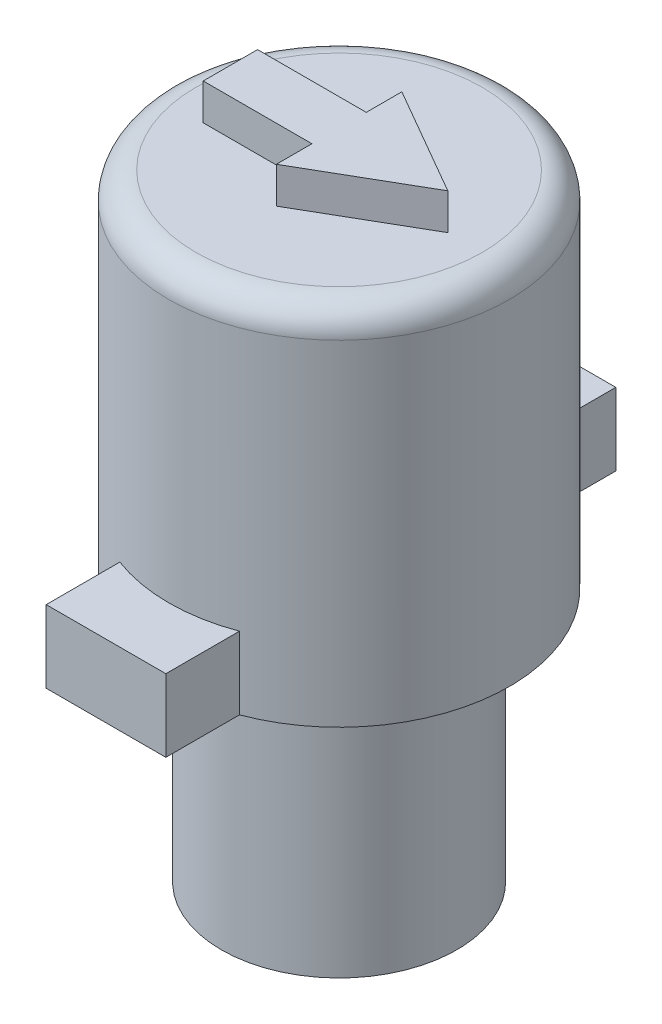
ISO-10303-21;
HEADER;
FILE_DESCRIPTION(('STEP AP214'),'2;1');
FILE_NAME('part.step','',(''),(''),'','','');
FILE_SCHEMA(('AUTOMOTIVE_DESIGN { 1 0 10303 214 1 1 1 1 }'));
ENDSEC;
DATA;
#1=APPLICATION_CONTEXT('core data for automotive mechanical design processes');
#2=APPLICATION_PROTOCOL_DEFINITION('international standard','automotive_design',2000,#1);
#3=PRODUCT_CONTEXT('',#1,'mechanical');
#4=PRODUCT('Part','Part','',(#3));
#5=PRODUCT_RELATED_PRODUCT_CATEGORY('part','',(#4));
#6=PRODUCT_DEFINITION_FORMATION('','',#4);
#7=PRODUCT_DEFINITION_CONTEXT('part definition',#1,'design');
#8=PRODUCT_DEFINITION('design','',#6,#7);
#9=PRODUCT_DEFINITION_SHAPE('','',#8);
#10=(LENGTH_UNIT() NAMED_UNIT(*) SI_UNIT(.MILLI.,.METRE.));
#11=(NAMED_UNIT(*) PLANE_ANGLE_UNIT() SI_UNIT($,.RADIAN.));
#12=(NAMED_UNIT(*) SI_UNIT($,.STERADIAN.) SOLID_ANGLE_UNIT());
#13=UNCERTAINTY_MEASURE_WITH_UNIT(LENGTH_MEASURE(1.E-05),#10,'distance_accuracy_value','');
#14=(GEOMETRIC_REPRESENTATION_CONTEXT(3) GLOBAL_UNCERTAINTY_ASSIGNED_CONTEXT((#13)) GLOBAL_UNIT_ASSIGNED_CONTEXT((#10,
#11,#12)) REPRESENTATION_CONTEXT('',''));
#15=CARTESIAN_POINT('',(0.,0.,0.));
#16=DIRECTION('',(0.,0.,1.));
#17=DIRECTION('',(1.,0.,0.));
#18=AXIS2_PLACEMENT_3D('',#15,#16,#17);
#19=CARTESIAN_POINT('',(0.,17.018,0.));
#20=DIRECTION('',(0.,1.,0.));
#21=DIRECTION('',(0.,0.,1.));
#22=AXIS2_PLACEMENT_3D('',#19,#20,#21);
#23=PLANE('',#22);
#24=CARTESIAN_POINT('',(0.,17.018,0.));
#25=DIRECTION('',(0.,1.,0.));
#26=DIRECTION('',(0.,0.,1.));
#27=AXIS2_PLACEMENT_3D('',#24,#25,#26);
#28=CIRCLE('',#27,3.95);
#29=CARTESIAN_POINT('',(0.,17.018,3.95));
#30=VERTEX_POINT('',#29);
#31=EDGE_CURVE('E72',#30,#30,#28,.T.);
#32=ORIENTED_EDGE('',*,*,#31,.T.);
#33=EDGE_LOOP('',(#32));
#34=FACE_BOUND('',#33,.T.);
#35=DIRECTION('',(-1.,0.,0.));
#36=VECTOR('',#35,1.);
#37=CARTESIAN_POINT('',(0.,17.018,-0.75));
#38=LINE('',#37,#36);
#39=CARTESIAN_POINT('',(0.,17.018,-0.75));
#40=VERTEX_POINT('',#39);
#41=CARTESIAN_POINT('',(-3.,17.018,-0.75));
#42=VERTEX_POINT('',#41);
#43=EDGE_CURVE('E285',#40,#42,#38,.T.);
#44=ORIENTED_EDGE('',*,*,#43,.F.);
#45=DIRECTION('',(0.,0.,1.));
#46=VECTOR('',#45,1.);
#47=CARTESIAN_POINT('',(0.,17.018,-1.73205080756888));
#48=LINE('',#47,#46);
#49=CARTESIAN_POINT('',(0.,17.018,-1.73205080756888));
#50=VERTEX_POINT('',#49);
#51=EDGE_CURVE('E213',#50,#40,#48,.T.);
#52=ORIENTED_EDGE('',*,*,#51,.F.);
#53=DIRECTION('',(-0.866025403784438,0.,-0.5));
#54=VECTOR('',#53,1.);
#55=CARTESIAN_POINT('',(3.,17.018,0.));
#56=LINE('',#55,#54);
#57=CARTESIAN_POINT('',(3.,17.018,0.));
#58=VERTEX_POINT('',#57);
#59=EDGE_CURVE('E263',#58,#50,#56,.T.);
#60=ORIENTED_EDGE('',*,*,#59,.F.);
#61=DIRECTION('',(0.866025403784439,0.,-0.5));
#62=VECTOR('',#61,1.);
#63=CARTESIAN_POINT('',(0.,17.018,1.73205080756888));
#64=LINE('',#63,#62);
#65=CARTESIAN_POINT('',(0.,17.018,1.73205080756888));
#66=VERTEX_POINT('',#65);
#67=EDGE_CURVE('E297',#66,#58,#64,.T.);
#68=ORIENTED_EDGE('',*,*,#67,.F.);
#69=DIRECTION('',(0.,0.,1.));
#70=VECTOR('',#69,1.);
#71=CARTESIAN_POINT('',(0.,17.018,0.75));
#72=LINE('',#71,#70);
#73=CARTESIAN_POINT('',(0.,17.018,0.75));
#74=VERTEX_POINT('',#73);
#75=EDGE_CURVE('E294',#74,#66,#72,.T.);
#76=ORIENTED_EDGE('',*,*,#75,.F.);
#77=DIRECTION('',(1.,0.,0.));
#78=VECTOR('',#77,1.);
#79=CARTESIAN_POINT('',(-3.,17.018,0.75));
#80=LINE('',#79,#78);
#81=CARTESIAN_POINT('',(-3.,17.018,0.75));
#82=VERTEX_POINT('',#81);
#83=EDGE_CURVE('E291',#82,#74,#80,.T.);
#84=ORIENTED_EDGE('',*,*,#83,.F.);
#85=DIRECTION('',(0.,0.,1.));
#86=VECTOR('',#85,1.);
#87=CARTESIAN_POINT('',(-3.,17.018,-0.75));
#88=LINE('',#87,#86);
#89=EDGE_CURVE('E288',#42,#82,#88,.T.);
#90=ORIENTED_EDGE('',*,*,#89,.F.);
#91=EDGE_LOOP('',(#44,#52,#60,#68,#76,#84,#90));
#92=FACE_BOUND('',#91,.T.);
#93=ADVANCED_FACE('F63',(#34,#92),#23,.T.);
#94=CARTESIAN_POINT('',(0.,7.018,0.));
#95=DIRECTION('',(0.,-1.,0.));
#96=DIRECTION('',(0.,0.,-1.));
#97=AXIS2_PLACEMENT_3D('',#94,#95,#96);
#98=CYLINDRICAL_SURFACE('',#97,3.25);
#99=CARTESIAN_POINT('',(0.,7.018,0.));
#100=DIRECTION('',(0.,1.,0.));
#101=DIRECTION('',(0.,0.,1.));
#102=AXIS2_PLACEMENT_3D('',#99,#100,#101);
#103=CIRCLE('',#102,3.25);
#104=CARTESIAN_POINT('',(0.,7.018,3.25));
#105=VERTEX_POINT('',#104);
#106=EDGE_CURVE('E333',#105,#105,#103,.T.);
#107=ORIENTED_EDGE('',*,*,#106,.F.);
#108=EDGE_LOOP('',(#107));
#109=FACE_BOUND('',#108,.T.);
#110=CARTESIAN_POINT('',(0.,0.,0.));
#111=DIRECTION('',(0.,1.,0.));
#112=DIRECTION('',(0.,0.,1.));
#113=AXIS2_PLACEMENT_3D('',#110,#111,#112);
#114=CIRCLE('',#113,3.25);
#115=CARTESIAN_POINT('',(0.,0.,3.25));
#116=VERTEX_POINT('',#115);
#117=EDGE_CURVE('E332',#116,#116,#114,.T.);
#118=ORIENTED_EDGE('',*,*,#117,.T.);
#119=EDGE_LOOP('',(#118));
#120=FACE_BOUND('',#119,.T.);
#121=ADVANCED_FACE('F362',(#109,#120),#98,.T.);
#122=CARTESIAN_POINT('',(0.,0.,0.));
#123=DIRECTION('',(0.,1.,0.));
#124=DIRECTION('',(0.,0.,1.));
#125=AXIS2_PLACEMENT_3D('',#122,#123,#124);
#126=PLANE('',#125);
#127=ORIENTED_EDGE('',*,*,#117,.F.);
#128=EDGE_LOOP('',(#127));
#129=FACE_BOUND('',#128,.T.);
#130=ADVANCED_FACE('F367',(#129),#126,.F.);
#131=CARTESIAN_POINT('',(0.,17.018,0.));
#132=DIRECTION('',(0.,-1.,0.));
#133=DIRECTION('',(0.,0.,-1.));
#134=AXIS2_PLACEMENT_3D('',#131,#132,#133);
#135=CYLINDRICAL_SURFACE('',#134,4.7);
#136=CARTESIAN_POINT('',(0.,7.018,0.));
#137=DIRECTION('',(0.,1.,0.));
#138=DIRECTION('',(0.,0.,1.));
#139=AXIS2_PLACEMENT_3D('',#136,#137,#138);
#140=CIRCLE('',#139,4.7);
#141=CARTESIAN_POINT('',(-1.016,7.018,-4.58887175676113));
#142=VERTEX_POINT('',#141);
#143=CARTESIAN_POINT('',(-1.651,7.018,4.4004771332209));
#144=VERTEX_POINT('',#143);
#145=EDGE_CURVE('E328',#142,#144,#140,.T.);
#146=ORIENTED_EDGE('',*,*,#145,.T.);
#147=DIRECTION('',(0.,-1.,0.));
#148=VECTOR('',#147,1.);
#149=CARTESIAN_POINT('',(-1.651,9.018,4.4004771332209));
#150=LINE('',#149,#148);
#151=CARTESIAN_POINT('',(-1.651,9.018,4.4004771332209));
#152=VERTEX_POINT('',#151);
#153=EDGE_CURVE('E79',#152,#144,#150,.T.);
#154=ORIENTED_EDGE('',*,*,#153,.F.);
#155=CARTESIAN_POINT('',(0.,9.018,0.));
#156=DIRECTION('',(0.,1.,0.));
#157=DIRECTION('',(0.,0.,-1.));
#158=AXIS2_PLACEMENT_3D('',#155,#156,#157);
#159=CIRCLE('',#158,4.7);
#160=CARTESIAN_POINT('',(1.651,9.018,4.4004771332209));
#161=VERTEX_POINT('',#160);
#162=EDGE_CURVE('E83',#152,#161,#159,.T.);
#163=ORIENTED_EDGE('',*,*,#162,.T.);
#164=DIRECTION('',(0.,-1.,0.));
#165=VECTOR('',#164,1.);
#166=CARTESIAN_POINT('',(1.651,9.018,4.4004771332209));
#167=LINE('',#166,#165);
#168=CARTESIAN_POINT('',(1.651,7.018,4.4004771332209));
#169=VERTEX_POINT('',#168);
#170=EDGE_CURVE('E183',#161,#169,#167,.T.);
#171=ORIENTED_EDGE('',*,*,#170,.T.);
#172=CARTESIAN_POINT('',(1.016,7.018,-4.58887175676113));
#173=VERTEX_POINT('',#172);
#174=EDGE_CURVE('E329',#169,#173,#140,.T.);
#175=ORIENTED_EDGE('',*,*,#174,.T.);
#176=DIRECTION('',(0.,-1.,0.));
#177=VECTOR('',#176,1.);
#178=CARTESIAN_POINT('',(1.016,9.018,-4.58887175676113));
#179=LINE('',#178,#177);
#180=CARTESIAN_POINT('',(1.016,9.018,-4.58887175676113));
#181=VERTEX_POINT('',#180);
#182=EDGE_CURVE('E229',#181,#173,#179,.T.);
#183=ORIENTED_EDGE('',*,*,#182,.F.);
#184=CARTESIAN_POINT('',(0.,9.018,0.));
#185=DIRECTION('',(0.,1.,0.));
#186=DIRECTION('',(0.,0.,-1.));
#187=AXIS2_PLACEMENT_3D('',#184,#185,#186);
#188=CIRCLE('',#187,4.7);
#189=CARTESIAN_POINT('',(-1.016,9.018,-4.58887175676113));
#190=VERTEX_POINT('',#189);
#191=EDGE_CURVE('E238',#181,#190,#188,.T.);
#192=ORIENTED_EDGE('',*,*,#191,.T.);
#193=DIRECTION('',(0.,-1.,0.));
#194=VECTOR('',#193,1.);
#195=CARTESIAN_POINT('',(-1.016,9.018,-4.58887175676113));
#196=LINE('',#195,#194);
#197=EDGE_CURVE('E218',#190,#142,#196,.T.);
#198=ORIENTED_EDGE('',*,*,#197,.T.);
#199=EDGE_LOOP('',(#146,#154,#163,#171,#175,#183,#192,#198));
#200=FACE_BOUND('',#199,.T.);
#201=CARTESIAN_POINT('',(0.,16.268,0.));
#202=DIRECTION('',(0.,1.,0.));
#203=DIRECTION('',(0.,0.,1.));
#204=AXIS2_PLACEMENT_3D('',#201,#202,#203);
#205=CIRCLE('',#204,4.7);
#206=CARTESIAN_POINT('',(0.,16.268,4.7));
#207=VERTEX_POINT('',#206);
#208=EDGE_CURVE('E12',#207,#207,#205,.F.);
#209=ORIENTED_EDGE('',*,*,#208,.T.);
#210=EDGE_LOOP('',(#209));
#211=FACE_BOUND('',#210,.T.);
#212=ADVANCED_FACE('F358',(#200,#211),#135,.T.);
#213=CARTESIAN_POINT('',(0.,7.018,0.));
#214=DIRECTION('',(0.,1.,0.));
#215=DIRECTION('',(0.,0.,1.));
#216=AXIS2_PLACEMENT_3D('',#213,#214,#215);
#217=PLANE('',#216);
#218=ORIENTED_EDGE('',*,*,#106,.T.);
#219=EDGE_LOOP('',(#218));
#220=FACE_BOUND('',#219,.T.);
#221=ORIENTED_EDGE('',*,*,#174,.F.);
#222=DIRECTION('',(0.,0.,1.));
#223=VECTOR('',#222,1.);
#224=CARTESIAN_POINT('',(1.651,7.018,6.4324771332209));
#225=LINE('',#224,#223);
#226=CARTESIAN_POINT('',(1.651,7.018,6.4324771332209));
#227=VERTEX_POINT('',#226);
#228=EDGE_CURVE('E202',#169,#227,#225,.T.);
#229=ORIENTED_EDGE('',*,*,#228,.T.);
#230=DIRECTION('',(-1.,0.,0.));
#231=VECTOR('',#230,1.);
#232=CARTESIAN_POINT('',(-1.651,7.018,6.4324771332209));
#233=LINE('',#232,#231);
#234=CARTESIAN_POINT('',(-1.651,7.018,6.4324771332209));
#235=VERTEX_POINT('',#234);
#236=EDGE_CURVE('E176',#227,#235,#233,.T.);
#237=ORIENTED_EDGE('',*,*,#236,.T.);
#238=DIRECTION('',(0.,0.,-1.));
#239=VECTOR('',#238,1.);
#240=CARTESIAN_POINT('',(-1.651,7.018,4.4004771332209));
#241=LINE('',#240,#239);
#242=EDGE_CURVE('E197',#235,#144,#241,.T.);
#243=ORIENTED_EDGE('',*,*,#242,.T.);
#244=ORIENTED_EDGE('',*,*,#145,.F.);
#245=DIRECTION('',(0.,0.,-1.));
#246=VECTOR('',#245,1.);
#247=CARTESIAN_POINT('',(-1.016,7.018,-4.58887175676113));
#248=LINE('',#247,#246);
#249=CARTESIAN_POINT('',(-1.016,7.018,-6.62087175676113));
#250=VERTEX_POINT('',#249);
#251=EDGE_CURVE('E205',#142,#250,#248,.T.);
#252=ORIENTED_EDGE('',*,*,#251,.T.);
#253=DIRECTION('',(1.,0.,0.));
#254=VECTOR('',#253,1.);
#255=CARTESIAN_POINT('',(-1.016,7.018,-6.62087175676113));
#256=LINE('',#255,#254);
#257=CARTESIAN_POINT('',(1.016,7.018,-6.62087175676113));
#258=VERTEX_POINT('',#257);
#259=EDGE_CURVE('E237',#250,#258,#256,.T.);
#260=ORIENTED_EDGE('',*,*,#259,.T.);
#261=DIRECTION('',(0.,0.,1.));
#262=VECTOR('',#261,1.);
#263=CARTESIAN_POINT('',(1.016,7.018,-6.62087175676113));
#264=LINE('',#263,#262);
#265=EDGE_CURVE('E233',#258,#173,#264,.T.);
#266=ORIENTED_EDGE('',*,*,#265,.T.);
#267=EDGE_LOOP('',(#221,#229,#237,#243,#244,#252,#260,#266));
#268=FACE_BOUND('',#267,.T.);
#269=ADVANCED_FACE('F347',(#220,#268),#217,.F.);
#270=CARTESIAN_POINT('',(0.,16.268,0.));
#271=DIRECTION('',(0.,1.,0.));
#272=DIRECTION('',(0.,0.,1.));
#273=AXIS2_PLACEMENT_3D('',#270,#271,#272);
#274=TOROIDAL_SURFACE('',#273,3.95,0.75);
#275=ORIENTED_EDGE('',*,*,#208,.F.);
#276=EDGE_LOOP('',(#275));
#277=FACE_BOUND('',#276,.T.);
#278=ORIENTED_EDGE('',*,*,#31,.F.);
#279=EDGE_LOOP('',(#278));
#280=FACE_BOUND('',#279,.T.);
#281=ADVANCED_FACE('F65',(#277,#280),#274,.T.);
#282=CARTESIAN_POINT('',(0.,18.018,-1.73205080756888));
#283=DIRECTION('',(1.,0.,0.));
#284=DIRECTION('',(0.,0.,-1.));
#285=AXIS2_PLACEMENT_3D('',#282,#283,#284);
#286=PLANE('',#285);
#287=ORIENTED_EDGE('',*,*,#51,.T.);
#288=DIRECTION('',(0.,-1.,0.));
#289=VECTOR('',#288,1.);
#290=CARTESIAN_POINT('',(0.,18.018,-0.75));
#291=LINE('',#290,#289);
#292=CARTESIAN_POINT('',(0.,18.018,-0.75));
#293=VERTEX_POINT('',#292);
#294=EDGE_CURVE('E325',#293,#40,#291,.T.);
#295=ORIENTED_EDGE('',*,*,#294,.F.);
#296=DIRECTION('',(0.,0.,1.));
#297=VECTOR('',#296,1.);
#298=CARTESIAN_POINT('',(0.,18.018,-1.73205080756888));
#299=LINE('',#298,#297);
#300=CARTESIAN_POINT('',(0.,18.018,-1.73205080756888));
#301=VERTEX_POINT('',#300);
#302=EDGE_CURVE('E258',#301,#293,#299,.T.);
#303=ORIENTED_EDGE('',*,*,#302,.F.);
#304=DIRECTION('',(0.,-1.,0.));
#305=VECTOR('',#304,1.);
#306=CARTESIAN_POINT('',(0.,18.018,-1.73205080756888));
#307=LINE('',#306,#305);
#308=EDGE_CURVE('E281',#301,#50,#307,.T.);
#309=ORIENTED_EDGE('',*,*,#308,.T.);
#310=EDGE_LOOP('',(#287,#295,#303,#309));
#311=FACE_BOUND('',#310,.T.);
#312=ADVANCED_FACE('F346',(#311),#286,.F.);
#313=CARTESIAN_POINT('',(0.,18.018,-0.75));
#314=DIRECTION('',(0.,0.,1.));
#315=DIRECTION('',(1.,0.,0.));
#316=AXIS2_PLACEMENT_3D('',#313,#314,#315);
#317=PLANE('',#316);
#318=ORIENTED_EDGE('',*,*,#43,.T.);
#319=DIRECTION('',(0.,-1.,0.));
#320=VECTOR('',#319,1.);
#321=CARTESIAN_POINT('',(-3.,18.018,-0.75));
#322=LINE('',#321,#320);
#323=CARTESIAN_POINT('',(-3.,18.018,-0.75));
#324=VERTEX_POINT('',#323);
#325=EDGE_CURVE('E321',#324,#42,#322,.T.);
#326=ORIENTED_EDGE('',*,*,#325,.F.);
#327=DIRECTION('',(-1.,0.,0.));
#328=VECTOR('',#327,1.);
#329=CARTESIAN_POINT('',(0.,18.018,-0.75));
#330=LINE('',#329,#328);
#331=EDGE_CURVE('E262',#293,#324,#330,.T.);
#332=ORIENTED_EDGE('',*,*,#331,.F.);
#333=ORIENTED_EDGE('',*,*,#294,.T.);
#334=EDGE_LOOP('',(#318,#326,#332,#333));
#335=FACE_BOUND('',#334,.T.);
#336=ADVANCED_FACE('F354',(#335),#317,.F.);
#337=CARTESIAN_POINT('',(-3.,18.018,-0.75));
#338=DIRECTION('',(1.,0.,0.));
#339=DIRECTION('',(0.,0.,-1.));
#340=AXIS2_PLACEMENT_3D('',#337,#338,#339);
#341=PLANE('',#340);
#342=ORIENTED_EDGE('',*,*,#89,.T.);
#343=DIRECTION('',(0.,-1.,0.));
#344=VECTOR('',#343,1.);
#345=CARTESIAN_POINT('',(-3.,18.018,0.75));
#346=LINE('',#345,#344);
#347=CARTESIAN_POINT('',(-3.,18.018,0.75));
#348=VERTEX_POINT('',#347);
#349=EDGE_CURVE('E317',#348,#82,#346,.T.);
#350=ORIENTED_EDGE('',*,*,#349,.F.);
#351=DIRECTION('',(0.,0.,1.));
#352=VECTOR('',#351,1.);
#353=CARTESIAN_POINT('',(-3.,18.018,-0.75));
#354=LINE('',#353,#352);
#355=EDGE_CURVE('E266',#324,#348,#354,.T.);
#356=ORIENTED_EDGE('',*,*,#355,.F.);
#357=ORIENTED_EDGE('',*,*,#325,.T.);
#358=EDGE_LOOP('',(#342,#350,#356,#357));
#359=FACE_BOUND('',#358,.T.);
#360=ADVANCED_FACE('F417',(#359),#341,.F.);
#361=CARTESIAN_POINT('',(-3.,18.018,0.75));
#362=DIRECTION('',(0.,0.,-1.));
#363=DIRECTION('',(-1.,0.,0.));
#364=AXIS2_PLACEMENT_3D('',#361,#362,#363);
#365=PLANE('',#364);
#366=ORIENTED_EDGE('',*,*,#83,.T.);
#367=DIRECTION('',(0.,-1.,0.));
#368=VECTOR('',#367,1.);
#369=CARTESIAN_POINT('',(0.,18.018,0.75));
#370=LINE('',#369,#368);
#371=CARTESIAN_POINT('',(0.,18.018,0.75));
#372=VERTEX_POINT('',#371);
#373=EDGE_CURVE('E313',#372,#74,#370,.T.);
#374=ORIENTED_EDGE('',*,*,#373,.F.);
#375=DIRECTION('',(1.,0.,0.));
#376=VECTOR('',#375,1.);
#377=CARTESIAN_POINT('',(-3.,18.018,0.75));
#378=LINE('',#377,#376);
#379=EDGE_CURVE('E269',#348,#372,#378,.T.);
#380=ORIENTED_EDGE('',*,*,#379,.F.);
#381=ORIENTED_EDGE('',*,*,#349,.T.);
#382=EDGE_LOOP('',(#366,#374,#380,#381));
#383=FACE_BOUND('',#382,.T.);
#384=ADVANCED_FACE('F425',(#383),#365,.F.);
#385=CARTESIAN_POINT('',(0.,18.018,0.75));
#386=DIRECTION('',(1.,0.,0.));
#387=DIRECTION('',(0.,0.,-1.));
#388=AXIS2_PLACEMENT_3D('',#385,#386,#387);
#389=PLANE('',#388);
#390=ORIENTED_EDGE('',*,*,#75,.T.);
#391=DIRECTION('',(0.,-1.,0.));
#392=VECTOR('',#391,1.);
#393=CARTESIAN_POINT('',(0.,18.018,1.73205080756888));
#394=LINE('',#393,#392);
#395=CARTESIAN_POINT('',(0.,18.018,1.73205080756888));
#396=VERTEX_POINT('',#395);
#397=EDGE_CURVE('E309',#396,#66,#394,.T.);
#398=ORIENTED_EDGE('',*,*,#397,.F.);
#399=DIRECTION('',(0.,0.,1.));
#400=VECTOR('',#399,1.);
#401=CARTESIAN_POINT('',(0.,18.018,0.75));
#402=LINE('',#401,#400);
#403=EDGE_CURVE('E272',#372,#396,#402,.T.);
#404=ORIENTED_EDGE('',*,*,#403,.F.);
#405=ORIENTED_EDGE('',*,*,#373,.T.);
#406=EDGE_LOOP('',(#390,#398,#404,#405));
#407=FACE_BOUND('',#406,.T.);
#408=ADVANCED_FACE('F434',(#407),#389,.F.);
#409=CARTESIAN_POINT('',(0.,18.018,1.73205080756888));
#410=DIRECTION('',(-0.5,0.,-0.866025403784439));
#411=DIRECTION('',(-0.866025403784439,0.,0.5));
#412=AXIS2_PLACEMENT_3D('',#409,#410,#411);
#413=PLANE('',#412);
#414=ORIENTED_EDGE('',*,*,#67,.T.);
#415=DIRECTION('',(0.,-1.,0.));
#416=VECTOR('',#415,1.);
#417=CARTESIAN_POINT('',(3.,18.018,0.));
#418=LINE('',#417,#416);
#419=CARTESIAN_POINT('',(3.,18.018,0.));
#420=VERTEX_POINT('',#419);
#421=EDGE_CURVE('E306',#420,#58,#418,.T.);
#422=ORIENTED_EDGE('',*,*,#421,.F.);
#423=DIRECTION('',(0.866025403784439,0.,-0.5));
#424=VECTOR('',#423,1.);
#425=CARTESIAN_POINT('',(0.,18.018,1.73205080756888));
#426=LINE('',#425,#424);
#427=EDGE_CURVE('E275',#396,#420,#426,.T.);
#428=ORIENTED_EDGE('',*,*,#427,.F.);
#429=ORIENTED_EDGE('',*,*,#397,.T.);
#430=EDGE_LOOP('',(#414,#422,#428,#429));
#431=FACE_BOUND('',#430,.T.);
#432=ADVANCED_FACE('F443',(#431),#413,.F.);
#433=CARTESIAN_POINT('',(3.,18.018,0.));
#434=DIRECTION('',(-0.5,0.,0.866025403784438));
#435=DIRECTION('',(0.866025403784438,0.,0.5));
#436=AXIS2_PLACEMENT_3D('',#433,#434,#435);
#437=PLANE('',#436);
#438=ORIENTED_EDGE('',*,*,#59,.T.);
#439=ORIENTED_EDGE('',*,*,#308,.F.);
#440=DIRECTION('',(-0.866025403784438,0.,-0.5));
#441=VECTOR('',#440,1.);
#442=CARTESIAN_POINT('',(3.,18.018,0.));
#443=LINE('',#442,#441);
#444=EDGE_CURVE('E278',#420,#301,#443,.T.);
#445=ORIENTED_EDGE('',*,*,#444,.F.);
#446=ORIENTED_EDGE('',*,*,#421,.T.);
#447=EDGE_LOOP('',(#438,#439,#445,#446));
#448=FACE_BOUND('',#447,.T.);
#449=ADVANCED_FACE('F452',(#448),#437,.F.);
#450=CARTESIAN_POINT('',(0.,18.018,0.));
#451=DIRECTION('',(0.,-1.,0.));
#452=DIRECTION('',(0.,0.,-1.));
#453=AXIS2_PLACEMENT_3D('',#450,#451,#452);
#454=PLANE('',#453);
#455=ORIENTED_EDGE('',*,*,#302,.T.);
#456=ORIENTED_EDGE('',*,*,#331,.T.);
#457=ORIENTED_EDGE('',*,*,#355,.T.);
#458=ORIENTED_EDGE('',*,*,#379,.T.);
#459=ORIENTED_EDGE('',*,*,#403,.T.);
#460=ORIENTED_EDGE('',*,*,#427,.T.);
#461=ORIENTED_EDGE('',*,*,#444,.T.);
#462=EDGE_LOOP('',(#455,#456,#457,#458,#459,#460,#461));
#463=FACE_BOUND('',#462,.T.);
#464=ADVANCED_FACE('F461',(#463),#454,.F.);
#465=CARTESIAN_POINT('',(1.016,9.018,-6.62087175676113));
#466=DIRECTION('',(1.,0.,0.));
#467=DIRECTION('',(0.,0.,-1.));
#468=AXIS2_PLACEMENT_3D('',#465,#466,#467);
#469=PLANE('',#468);
#470=ORIENTED_EDGE('',*,*,#265,.F.);
#471=DIRECTION('',(0.,-1.,0.));
#472=VECTOR('',#471,1.);
#473=CARTESIAN_POINT('',(1.016,9.018,-6.62087175676113));
#474=LINE('',#473,#472);
#475=CARTESIAN_POINT('',(1.016,9.018,-6.62087175676113));
#476=VERTEX_POINT('',#475);
#477=EDGE_CURVE('E226',#476,#258,#474,.T.);
#478=ORIENTED_EDGE('',*,*,#477,.F.);
#479=DIRECTION('',(0.,0.,1.));
#480=VECTOR('',#479,1.);
#481=CARTESIAN_POINT('',(1.016,9.018,-6.62087175676113));
#482=LINE('',#481,#480);
#483=EDGE_CURVE('E222',#476,#181,#482,.T.);
#484=ORIENTED_EDGE('',*,*,#483,.T.);
#485=ORIENTED_EDGE('',*,*,#182,.T.);
#486=EDGE_LOOP('',(#470,#478,#484,#485));
#487=FACE_BOUND('',#486,.T.);
#488=ADVANCED_FACE('F470',(#487),#469,.T.);
#489=CARTESIAN_POINT('',(-1.016,9.018,-6.62087175676113));
#490=DIRECTION('',(0.,0.,-1.));
#491=DIRECTION('',(-1.,0.,0.));
#492=AXIS2_PLACEMENT_3D('',#489,#490,#491);
#493=PLANE('',#492);
#494=ORIENTED_EDGE('',*,*,#259,.F.);
#495=DIRECTION('',(0.,-1.,0.));
#496=VECTOR('',#495,1.);
#497=CARTESIAN_POINT('',(-1.016,9.018,-6.62087175676113));
#498=LINE('',#497,#496);
#499=CARTESIAN_POINT('',(-1.016,9.018,-6.62087175676113));
#500=VERTEX_POINT('',#499);
#501=EDGE_CURVE('E223',#500,#250,#498,.T.);
#502=ORIENTED_EDGE('',*,*,#501,.F.);
#503=DIRECTION('',(1.,0.,0.));
#504=VECTOR('',#503,1.);
#505=CARTESIAN_POINT('',(-1.016,9.018,-6.62087175676113));
#506=LINE('',#505,#504);
#507=EDGE_CURVE('E248',#500,#476,#506,.T.);
#508=ORIENTED_EDGE('',*,*,#507,.T.);
#509=ORIENTED_EDGE('',*,*,#477,.T.);
#510=EDGE_LOOP('',(#494,#502,#508,#509));
#511=FACE_BOUND('',#510,.T.);
#512=ADVANCED_FACE('F479',(#511),#493,.T.);
#513=CARTESIAN_POINT('',(-1.016,9.018,-4.58887175676113));
#514=DIRECTION('',(-1.,0.,0.));
#515=DIRECTION('',(0.,0.,1.));
#516=AXIS2_PLACEMENT_3D('',#513,#514,#515);
#517=PLANE('',#516);
#518=ORIENTED_EDGE('',*,*,#251,.F.);
#519=ORIENTED_EDGE('',*,*,#197,.F.);
#520=DIRECTION('',(0.,0.,-1.));
#521=VECTOR('',#520,1.);
#522=CARTESIAN_POINT('',(-1.016,9.018,-4.58887175676113));
#523=LINE('',#522,#521);
#524=EDGE_CURVE('E252',#190,#500,#523,.T.);
#525=ORIENTED_EDGE('',*,*,#524,.T.);
#526=ORIENTED_EDGE('',*,*,#501,.T.);
#527=EDGE_LOOP('',(#518,#519,#525,#526));
#528=FACE_BOUND('',#527,.T.);
#529=ADVANCED_FACE('F489',(#528),#517,.T.);
#530=CARTESIAN_POINT('',(0.,9.018,0.));
#531=DIRECTION('',(0.,-1.,0.));
#532=DIRECTION('',(0.,0.,-1.));
#533=AXIS2_PLACEMENT_3D('',#530,#531,#532);
#534=PLANE('',#533);
#535=ORIENTED_EDGE('',*,*,#191,.F.);
#536=ORIENTED_EDGE('',*,*,#483,.F.);
#537=ORIENTED_EDGE('',*,*,#507,.F.);
#538=ORIENTED_EDGE('',*,*,#524,.F.);
#539=EDGE_LOOP('',(#535,#536,#537,#538));
#540=FACE_BOUND('',#539,.T.);
#541=ADVANCED_FACE('F498',(#540),#534,.F.);
#542=CARTESIAN_POINT('',(-1.651,9.018,4.4004771332209));
#543=DIRECTION('',(-1.,0.,0.));
#544=DIRECTION('',(0.,0.,1.));
#545=AXIS2_PLACEMENT_3D('',#542,#543,#544);
#546=PLANE('',#545);
#547=ORIENTED_EDGE('',*,*,#242,.F.);
#548=DIRECTION('',(0.,-1.,0.));
#549=VECTOR('',#548,1.);
#550=CARTESIAN_POINT('',(-1.651,9.018,6.4324771332209));
#551=LINE('',#550,#549);
#552=CARTESIAN_POINT('',(-1.651,9.018,6.4324771332209));
#553=VERTEX_POINT('',#552);
#554=EDGE_CURVE('E182',#553,#235,#551,.T.);
#555=ORIENTED_EDGE('',*,*,#554,.F.);
#556=DIRECTION('',(0.,0.,-1.));
#557=VECTOR('',#556,1.);
#558=CARTESIAN_POINT('',(-1.651,9.018,4.4004771332209));
#559=LINE('',#558,#557);
#560=EDGE_CURVE('E190',#553,#152,#559,.T.);
#561=ORIENTED_EDGE('',*,*,#560,.T.);
#562=ORIENTED_EDGE('',*,*,#153,.T.);
#563=EDGE_LOOP('',(#547,#555,#561,#562));
#564=FACE_BOUND('',#563,.T.);
#565=ADVANCED_FACE('F507',(#564),#546,.T.);
#566=CARTESIAN_POINT('',(-1.651,9.018,6.4324771332209));
#567=DIRECTION('',(0.,0.,1.));
#568=DIRECTION('',(1.,0.,0.));
#569=AXIS2_PLACEMENT_3D('',#566,#567,#568);
#570=PLANE('',#569);
#571=ORIENTED_EDGE('',*,*,#236,.F.);
#572=DIRECTION('',(0.,-1.,0.));
#573=VECTOR('',#572,1.);
#574=CARTESIAN_POINT('',(1.651,9.018,6.4324771332209));
#575=LINE('',#574,#573);
#576=CARTESIAN_POINT('',(1.651,9.018,6.4324771332209));
#577=VERTEX_POINT('',#576);
#578=EDGE_CURVE('E170',#577,#227,#575,.T.);
#579=ORIENTED_EDGE('',*,*,#578,.F.);
#580=DIRECTION('',(-1.,0.,0.));
#581=VECTOR('',#580,1.);
#582=CARTESIAN_POINT('',(-1.651,9.018,6.4324771332209));
#583=LINE('',#582,#581);
#584=EDGE_CURVE('E173',#577,#553,#583,.T.);
#585=ORIENTED_EDGE('',*,*,#584,.T.);
#586=ORIENTED_EDGE('',*,*,#554,.T.);
#587=EDGE_LOOP('',(#571,#579,#585,#586));
#588=FACE_BOUND('',#587,.T.);
#589=ADVANCED_FACE('F172',(#588),#570,.T.);
#590=CARTESIAN_POINT('',(1.651,9.018,6.4324771332209));
#591=DIRECTION('',(1.,0.,0.));
#592=DIRECTION('',(0.,0.,-1.));
#593=AXIS2_PLACEMENT_3D('',#590,#591,#592);
#594=PLANE('',#593);
#595=ORIENTED_EDGE('',*,*,#228,.F.);
#596=ORIENTED_EDGE('',*,*,#170,.F.);
#597=DIRECTION('',(0.,0.,1.));
#598=VECTOR('',#597,1.);
#599=CARTESIAN_POINT('',(1.651,9.018,6.4324771332209));
#600=LINE('',#599,#598);
#601=EDGE_CURVE('E188',#161,#577,#600,.T.);
#602=ORIENTED_EDGE('',*,*,#601,.T.);
#603=ORIENTED_EDGE('',*,*,#578,.T.);
#604=EDGE_LOOP('',(#595,#596,#602,#603));
#605=FACE_BOUND('',#604,.T.);
#606=ADVANCED_FACE('F193',(#605),#594,.T.);
#607=CARTESIAN_POINT('',(0.,9.018,0.));
#608=DIRECTION('',(0.,-1.,0.));
#609=DIRECTION('',(0.,0.,-1.));
#610=AXIS2_PLACEMENT_3D('',#607,#608,#609);
#611=PLANE('',#610);
#612=ORIENTED_EDGE('',*,*,#162,.F.);
#613=ORIENTED_EDGE('',*,*,#560,.F.);
#614=ORIENTED_EDGE('',*,*,#584,.F.);
#615=ORIENTED_EDGE('',*,*,#601,.F.);
#616=EDGE_LOOP('',(#612,#613,#614,#615));
#617=FACE_BOUND('',#616,.T.);
#618=ADVANCED_FACE('F187',(#617),#611,.F.);
#619=CLOSED_SHELL('',(#93,#121,#130,#212,#269,#281,#312,#336,#360,#384,#408,#432,#449,#464,#488,
#512,#529,#541,#565,#589,#606,#618));
#620=MANIFOLD_SOLID_BREP('B2',#619);
#621=ADVANCED_BREP_SHAPE_REPRESENTATION('',(#18,#620),#14);
#622=SHAPE_DEFINITION_REPRESENTATION(#9,#621);
ENDSEC;
END-ISO-10303-21;
